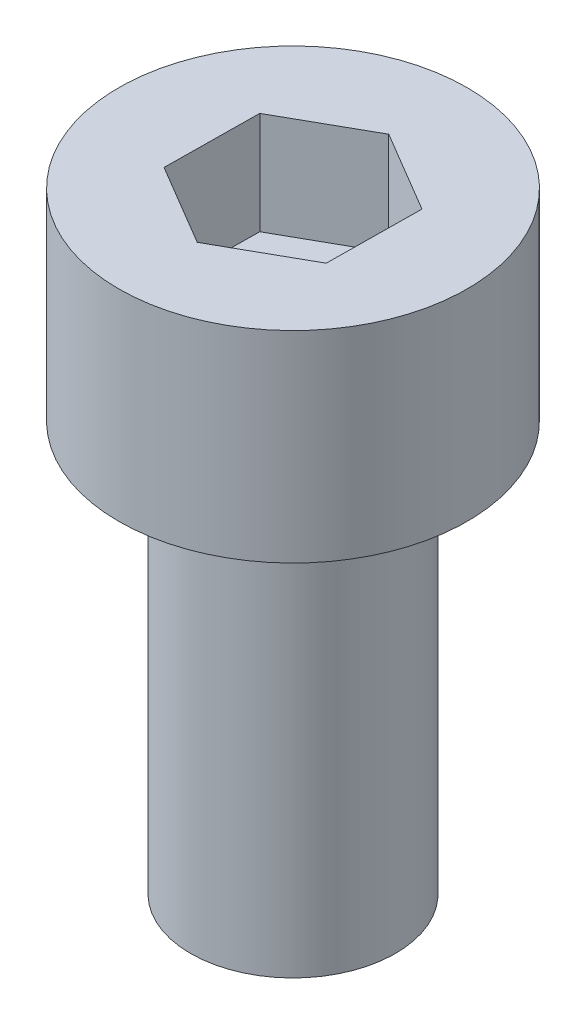
ISO-10303-21;
HEADER;
FILE_DESCRIPTION(('STEP AP214'),'2;1');
FILE_NAME('part.step','',(''),(''),'','','');
FILE_SCHEMA(('AUTOMOTIVE_DESIGN { 1 0 10303 214 1 1 1 1 }'));
ENDSEC;
DATA;
#1=APPLICATION_CONTEXT('core data for automotive mechanical design processes');
#2=APPLICATION_PROTOCOL_DEFINITION('international standard','automotive_design',2000,#1);
#3=PRODUCT_CONTEXT('',#1,'mechanical');
#4=PRODUCT('Part','Part','',(#3));
#5=PRODUCT_RELATED_PRODUCT_CATEGORY('part','',(#4));
#6=PRODUCT_DEFINITION_FORMATION('','',#4);
#7=PRODUCT_DEFINITION_CONTEXT('part definition',#1,'design');
#8=PRODUCT_DEFINITION('design','',#6,#7);
#9=PRODUCT_DEFINITION_SHAPE('','',#8);
#10=(LENGTH_UNIT() NAMED_UNIT(*) SI_UNIT(.MILLI.,.METRE.));
#11=(NAMED_UNIT(*) PLANE_ANGLE_UNIT() SI_UNIT($,.RADIAN.));
#12=(NAMED_UNIT(*) SI_UNIT($,.STERADIAN.) SOLID_ANGLE_UNIT());
#13=UNCERTAINTY_MEASURE_WITH_UNIT(LENGTH_MEASURE(1.E-05),#10,'distance_accuracy_value','');
#14=(GEOMETRIC_REPRESENTATION_CONTEXT(3) GLOBAL_UNCERTAINTY_ASSIGNED_CONTEXT((#13)) GLOBAL_UNIT_ASSIGNED_CONTEXT((#10,
#11,#12)) REPRESENTATION_CONTEXT('',''));
#15=CARTESIAN_POINT('',(0.,0.,0.));
#16=DIRECTION('',(0.,0.,1.));
#17=DIRECTION('',(1.,0.,0.));
#18=AXIS2_PLACEMENT_3D('',#15,#16,#17);
#19=CARTESIAN_POINT('',(0.,10.,0.));
#20=DIRECTION('',(0.,-1.,0.));
#21=DIRECTION('',(0.,0.,-1.));
#22=AXIS2_PLACEMENT_3D('',#19,#20,#21);
#23=CYLINDRICAL_SURFACE('',#22,2.5);
#24=CARTESIAN_POINT('',(0.,10.,0.));
#25=DIRECTION('',(0.,1.,0.));
#26=DIRECTION('',(0.,0.,1.));
#27=AXIS2_PLACEMENT_3D('',#24,#25,#26);
#28=CIRCLE('',#27,2.5);
#29=CARTESIAN_POINT('',(0.,10.,2.5));
#30=VERTEX_POINT('',#29);
#31=EDGE_CURVE('E11',#30,#30,#28,.T.);
#32=ORIENTED_EDGE('',*,*,#31,.F.);
#33=EDGE_LOOP('',(#32));
#34=FACE_BOUND('',#33,.T.);
#35=CARTESIAN_POINT('',(0.,0.,0.));
#36=DIRECTION('',(0.,1.,0.));
#37=DIRECTION('',(0.,0.,1.));
#38=AXIS2_PLACEMENT_3D('',#35,#36,#37);
#39=CIRCLE('',#38,2.5);
#40=CARTESIAN_POINT('',(0.,0.,2.5));
#41=VERTEX_POINT('',#40);
#42=EDGE_CURVE('E42',#41,#41,#39,.T.);
#43=ORIENTED_EDGE('',*,*,#42,.T.);
#44=EDGE_LOOP('',(#43));
#45=FACE_BOUND('',#44,.T.);
#46=ADVANCED_FACE('F39',(#34,#45),#23,.T.);
#47=CARTESIAN_POINT('',(0.,0.,0.));
#48=DIRECTION('',(0.,1.,0.));
#49=DIRECTION('',(0.,0.,1.));
#50=AXIS2_PLACEMENT_3D('',#47,#48,#49);
#51=PLANE('',#50);
#52=ORIENTED_EDGE('',*,*,#42,.F.);
#53=EDGE_LOOP('',(#52));
#54=FACE_BOUND('',#53,.T.);
#55=ADVANCED_FACE('F189',(#54),#51,.F.);
#56=CARTESIAN_POINT('',(0.,14.91,0.));
#57=DIRECTION('',(0.,-1.,0.));
#58=DIRECTION('',(0.,0.,-1.));
#59=AXIS2_PLACEMENT_3D('',#56,#57,#58);
#60=CYLINDRICAL_SURFACE('',#59,4.25);
#61=CARTESIAN_POINT('',(0.,14.91,0.));
#62=DIRECTION('',(0.,1.,0.));
#63=DIRECTION('',(0.,0.,1.));
#64=AXIS2_PLACEMENT_3D('',#61,#62,#63);
#65=CIRCLE('',#64,4.25);
#66=CARTESIAN_POINT('',(0.,14.91,4.25));
#67=VERTEX_POINT('',#66);
#68=EDGE_CURVE('E163',#67,#67,#65,.T.);
#69=ORIENTED_EDGE('',*,*,#68,.F.);
#70=EDGE_LOOP('',(#69));
#71=FACE_BOUND('',#70,.T.);
#72=CARTESIAN_POINT('',(0.,10.,0.));
#73=DIRECTION('',(0.,1.,0.));
#74=DIRECTION('',(0.,0.,1.));
#75=AXIS2_PLACEMENT_3D('',#72,#73,#74);
#76=CIRCLE('',#75,4.25);
#77=CARTESIAN_POINT('',(0.,10.,4.25));
#78=VERTEX_POINT('',#77);
#79=EDGE_CURVE('E153',#78,#78,#76,.T.);
#80=ORIENTED_EDGE('',*,*,#79,.T.);
#81=EDGE_LOOP('',(#80));
#82=FACE_BOUND('',#81,.T.);
#83=ADVANCED_FACE('F171',(#71,#82),#60,.T.);
#84=CARTESIAN_POINT('',(0.,14.91,0.));
#85=DIRECTION('',(0.,1.,0.));
#86=DIRECTION('',(0.,0.,1.));
#87=AXIS2_PLACEMENT_3D('',#84,#85,#86);
#88=PLANE('',#87);
#89=DIRECTION('',(0.871446941935933,0.,-0.490489783166286));
#90=VECTOR('',#89,1.);
#91=CARTESIAN_POINT('',(-0.0252806866898007,14.91,2.3092627005635));
#92=LINE('',#91,#90);
#93=CARTESIAN_POINT('',(-0.0252806866898007,14.91,2.3092627005635));
#94=VERTEX_POINT('',#93);
#95=CARTESIAN_POINT('',(1.98723981935495,14.91,1.17652506718023));
#96=VERTEX_POINT('',#95);
#97=EDGE_CURVE('E54',#94,#96,#92,.T.);
#98=ORIENTED_EDGE('',*,*,#97,.F.);
#99=DIRECTION('',(0.860500083486691,0.,0.509450298183638));
#100=VECTOR('',#99,1.);
#101=CARTESIAN_POINT('',(-2.01252050604475,14.91,1.13273763338327));
#102=LINE('',#101,#100);
#103=CARTESIAN_POINT('',(-2.01252050604475,14.91,1.13273763338327));
#104=VERTEX_POINT('',#103);
#105=EDGE_CURVE('E147',#104,#94,#102,.T.);
#106=ORIENTED_EDGE('',*,*,#105,.F.);
#107=DIRECTION('',(-0.0109468584492415,0.,0.999940081349924));
#108=VECTOR('',#107,1.);
#109=CARTESIAN_POINT('',(-1.98723981935495,14.91,-1.17652506718023));
#110=LINE('',#109,#108);
#111=CARTESIAN_POINT('',(-1.98723981935495,14.91,-1.17652506718023));
#112=VERTEX_POINT('',#111);
#113=EDGE_CURVE('E144',#112,#104,#110,.T.);
#114=ORIENTED_EDGE('',*,*,#113,.F.);
#115=DIRECTION('',(-0.871446941935933,0.,0.490489783166286));
#116=VECTOR('',#115,1.);
#117=CARTESIAN_POINT('',(0.0252806866898017,14.91,-2.3092627005635));
#118=LINE('',#117,#116);
#119=CARTESIAN_POINT('',(0.0252806866898017,14.91,-2.3092627005635));
#120=VERTEX_POINT('',#119);
#121=EDGE_CURVE('E102',#120,#112,#118,.T.);
#122=ORIENTED_EDGE('',*,*,#121,.F.);
#123=DIRECTION('',(-0.860500083486691,0.,-0.509450298183638));
#124=VECTOR('',#123,1.);
#125=CARTESIAN_POINT('',(2.01252050604475,14.91,-1.13273763338327));
#126=LINE('',#125,#124);
#127=CARTESIAN_POINT('',(2.01252050604475,14.91,-1.13273763338327));
#128=VERTEX_POINT('',#127);
#129=EDGE_CURVE('E138',#128,#120,#126,.T.);
#130=ORIENTED_EDGE('',*,*,#129,.F.);
#131=DIRECTION('',(0.0109468584492411,0.,-0.999940081349924));
#132=VECTOR('',#131,1.);
#133=CARTESIAN_POINT('',(1.98723981935495,14.91,1.17652506718023));
#134=LINE('',#133,#132);
#135=EDGE_CURVE('E134',#96,#128,#134,.T.);
#136=ORIENTED_EDGE('',*,*,#135,.F.);
#137=EDGE_LOOP('',(#98,#106,#114,#122,#130,#136));
#138=FACE_BOUND('',#137,.T.);
#139=ORIENTED_EDGE('',*,*,#68,.T.);
#140=EDGE_LOOP('',(#139));
#141=FACE_BOUND('',#140,.T.);
#142=ADVANCED_FACE('F176',(#138,#141),#88,.T.);
#143=CARTESIAN_POINT('',(0.,10.,0.));
#144=DIRECTION('',(0.,1.,0.));
#145=DIRECTION('',(0.,0.,1.));
#146=AXIS2_PLACEMENT_3D('',#143,#144,#145);
#147=PLANE('',#146);
#148=ORIENTED_EDGE('',*,*,#31,.T.);
#149=EDGE_LOOP('',(#148));
#150=FACE_BOUND('',#149,.T.);
#151=ORIENTED_EDGE('',*,*,#79,.F.);
#152=EDGE_LOOP('',(#151));
#153=FACE_BOUND('',#152,.T.);
#154=ADVANCED_FACE('F173',(#150,#153),#147,.F.);
#155=CARTESIAN_POINT('',(-0.0252806866898007,12.41,2.3092627005635));
#156=DIRECTION('',(0.490489783166286,0.,0.871446941935933));
#157=DIRECTION('',(0.871446941935933,0.,-0.490489783166286));
#158=AXIS2_PLACEMENT_3D('',#155,#156,#157);
#159=PLANE('',#158);
#160=ORIENTED_EDGE('',*,*,#97,.T.);
#161=DIRECTION('',(0.,1.,0.));
#162=VECTOR('',#161,1.);
#163=CARTESIAN_POINT('',(1.98723981935495,12.41,1.17652506718023));
#164=LINE('',#163,#162);
#165=CARTESIAN_POINT('',(1.98723981935495,12.41,1.17652506718023));
#166=VERTEX_POINT('',#165);
#167=EDGE_CURVE('E84',#166,#96,#164,.T.);
#168=ORIENTED_EDGE('',*,*,#167,.F.);
#169=DIRECTION('',(0.871446941935933,0.,-0.490489783166286));
#170=VECTOR('',#169,1.);
#171=CARTESIAN_POINT('',(-0.0252806866898007,12.41,2.3092627005635));
#172=LINE('',#171,#170);
#173=CARTESIAN_POINT('',(-0.0252806866898007,12.41,2.3092627005635));
#174=VERTEX_POINT('',#173);
#175=EDGE_CURVE('E150',#174,#166,#172,.T.);
#176=ORIENTED_EDGE('',*,*,#175,.F.);
#177=DIRECTION('',(0.,1.,0.));
#178=VECTOR('',#177,1.);
#179=CARTESIAN_POINT('',(-0.0252806866898007,12.41,2.3092627005635));
#180=LINE('',#179,#178);
#181=EDGE_CURVE('E62',#174,#94,#180,.T.);
#182=ORIENTED_EDGE('',*,*,#181,.T.);
#183=EDGE_LOOP('',(#160,#168,#176,#182));
#184=FACE_BOUND('',#183,.T.);
#185=ADVANCED_FACE('F175',(#184),#159,.F.);
#186=CARTESIAN_POINT('',(-2.01252050604475,12.41,1.13273763338327));
#187=DIRECTION('',(-0.509450298183638,0.,0.860500083486691));
#188=DIRECTION('',(0.860500083486691,0.,0.509450298183638));
#189=AXIS2_PLACEMENT_3D('',#186,#187,#188);
#190=PLANE('',#189);
#191=ORIENTED_EDGE('',*,*,#105,.T.);
#192=ORIENTED_EDGE('',*,*,#181,.F.);
#193=DIRECTION('',(0.860500083486691,0.,0.509450298183638));
#194=VECTOR('',#193,1.);
#195=CARTESIAN_POINT('',(-2.01252050604475,12.41,1.13273763338327));
#196=LINE('',#195,#194);
#197=CARTESIAN_POINT('',(-2.01252050604475,12.41,1.13273763338327));
#198=VERTEX_POINT('',#197);
#199=EDGE_CURVE('E116',#198,#174,#196,.T.);
#200=ORIENTED_EDGE('',*,*,#199,.F.);
#201=DIRECTION('',(0.,1.,0.));
#202=VECTOR('',#201,1.);
#203=CARTESIAN_POINT('',(-2.01252050604475,12.41,1.13273763338327));
#204=LINE('',#203,#202);
#205=EDGE_CURVE('E107',#198,#104,#204,.T.);
#206=ORIENTED_EDGE('',*,*,#205,.T.);
#207=EDGE_LOOP('',(#191,#192,#200,#206));
#208=FACE_BOUND('',#207,.T.);
#209=ADVANCED_FACE('F183',(#208),#190,.F.);
#210=CARTESIAN_POINT('',(-1.98723981935495,12.41,-1.17652506718023));
#211=DIRECTION('',(-0.999940081349924,0.,-0.0109468584492415));
#212=DIRECTION('',(-0.0109468584492415,0.,0.999940081349924));
#213=AXIS2_PLACEMENT_3D('',#210,#211,#212);
#214=PLANE('',#213);
#215=ORIENTED_EDGE('',*,*,#113,.T.);
#216=ORIENTED_EDGE('',*,*,#205,.F.);
#217=DIRECTION('',(-0.0109468584492415,0.,0.999940081349924));
#218=VECTOR('',#217,1.);
#219=CARTESIAN_POINT('',(-1.98723981935495,12.41,-1.17652506718023));
#220=LINE('',#219,#218);
#221=CARTESIAN_POINT('',(-1.98723981935495,12.41,-1.17652506718023));
#222=VERTEX_POINT('',#221);
#223=EDGE_CURVE('E111',#222,#198,#220,.T.);
#224=ORIENTED_EDGE('',*,*,#223,.F.);
#225=DIRECTION('',(0.,1.,0.));
#226=VECTOR('',#225,1.);
#227=CARTESIAN_POINT('',(-1.98723981935495,12.41,-1.17652506718023));
#228=LINE('',#227,#226);
#229=EDGE_CURVE('E95',#222,#112,#228,.T.);
#230=ORIENTED_EDGE('',*,*,#229,.T.);
#231=EDGE_LOOP('',(#215,#216,#224,#230));
#232=FACE_BOUND('',#231,.T.);
#233=ADVANCED_FACE('F112',(#232),#214,.F.);
#234=CARTESIAN_POINT('',(0.0252806866898017,12.41,-2.3092627005635));
#235=DIRECTION('',(-0.490489783166286,0.,-0.871446941935933));
#236=DIRECTION('',(-0.871446941935933,0.,0.490489783166286));
#237=AXIS2_PLACEMENT_3D('',#234,#235,#236);
#238=PLANE('',#237);
#239=ORIENTED_EDGE('',*,*,#121,.T.);
#240=ORIENTED_EDGE('',*,*,#229,.F.);
#241=DIRECTION('',(-0.871446941935933,0.,0.490489783166286));
#242=VECTOR('',#241,1.);
#243=CARTESIAN_POINT('',(0.0252806866898017,12.41,-2.3092627005635));
#244=LINE('',#243,#242);
#245=CARTESIAN_POINT('',(0.0252806866898017,12.41,-2.3092627005635));
#246=VERTEX_POINT('',#245);
#247=EDGE_CURVE('E99',#246,#222,#244,.T.);
#248=ORIENTED_EDGE('',*,*,#247,.F.);
#249=DIRECTION('',(0.,1.,0.));
#250=VECTOR('',#249,1.);
#251=CARTESIAN_POINT('',(0.0252806866898017,12.41,-2.3092627005635));
#252=LINE('',#251,#250);
#253=EDGE_CURVE('E108',#246,#120,#252,.T.);
#254=ORIENTED_EDGE('',*,*,#253,.T.);
#255=EDGE_LOOP('',(#239,#240,#248,#254));
#256=FACE_BOUND('',#255,.T.);
#257=ADVANCED_FACE('F97',(#256),#238,.F.);
#258=CARTESIAN_POINT('',(2.01252050604475,12.41,-1.13273763338327));
#259=DIRECTION('',(0.509450298183638,0.,-0.860500083486691));
#260=DIRECTION('',(-0.860500083486691,0.,-0.509450298183638));
#261=AXIS2_PLACEMENT_3D('',#258,#259,#260);
#262=PLANE('',#261);
#263=ORIENTED_EDGE('',*,*,#129,.T.);
#264=ORIENTED_EDGE('',*,*,#253,.F.);
#265=DIRECTION('',(-0.860500083486691,0.,-0.509450298183638));
#266=VECTOR('',#265,1.);
#267=CARTESIAN_POINT('',(2.01252050604475,12.41,-1.13273763338327));
#268=LINE('',#267,#266);
#269=CARTESIAN_POINT('',(2.01252050604475,12.41,-1.13273763338327));
#270=VERTEX_POINT('',#269);
#271=EDGE_CURVE('E122',#270,#246,#268,.T.);
#272=ORIENTED_EDGE('',*,*,#271,.F.);
#273=DIRECTION('',(0.,1.,0.));
#274=VECTOR('',#273,1.);
#275=CARTESIAN_POINT('',(2.01252050604475,12.41,-1.13273763338327));
#276=LINE('',#275,#274);
#277=EDGE_CURVE('E158',#270,#128,#276,.T.);
#278=ORIENTED_EDGE('',*,*,#277,.T.);
#279=EDGE_LOOP('',(#263,#264,#272,#278));
#280=FACE_BOUND('',#279,.T.);
#281=ADVANCED_FACE('F245',(#280),#262,.F.);
#282=CARTESIAN_POINT('',(1.98723981935495,12.41,1.17652506718023));
#283=DIRECTION('',(0.999940081349924,0.,0.0109468584492411));
#284=DIRECTION('',(0.0109468584492411,0.,-0.999940081349924));
#285=AXIS2_PLACEMENT_3D('',#282,#283,#284);
#286=PLANE('',#285);
#287=ORIENTED_EDGE('',*,*,#135,.T.);
#288=ORIENTED_EDGE('',*,*,#277,.F.);
#289=DIRECTION('',(0.0109468584492411,0.,-0.999940081349924));
#290=VECTOR('',#289,1.);
#291=CARTESIAN_POINT('',(1.98723981935495,12.41,1.17652506718023));
#292=LINE('',#291,#290);
#293=EDGE_CURVE('E126',#166,#270,#292,.T.);
#294=ORIENTED_EDGE('',*,*,#293,.F.);
#295=ORIENTED_EDGE('',*,*,#167,.T.);
#296=EDGE_LOOP('',(#287,#288,#294,#295));
#297=FACE_BOUND('',#296,.T.);
#298=ADVANCED_FACE('F254',(#297),#286,.F.);
#299=CARTESIAN_POINT('',(0.,12.41,0.));
#300=DIRECTION('',(0.,1.,0.));
#301=DIRECTION('',(0.,0.,1.));
#302=AXIS2_PLACEMENT_3D('',#299,#300,#301);
#303=PLANE('',#302);
#304=ORIENTED_EDGE('',*,*,#175,.T.);
#305=ORIENTED_EDGE('',*,*,#293,.T.);
#306=ORIENTED_EDGE('',*,*,#271,.T.);
#307=ORIENTED_EDGE('',*,*,#247,.T.);
#308=ORIENTED_EDGE('',*,*,#223,.T.);
#309=ORIENTED_EDGE('',*,*,#199,.T.);
#310=EDGE_LOOP('',(#304,#305,#306,#307,#308,#309));
#311=FACE_BOUND('',#310,.T.);
#312=ADVANCED_FACE('F119',(#311),#303,.T.);
#313=CLOSED_SHELL('',(#46,#55,#83,#142,#154,#185,#209,#233,#257,#281,#298,#312));
#314=MANIFOLD_SOLID_BREP('B2',#313);
#315=ADVANCED_BREP_SHAPE_REPRESENTATION('',(#18,#314),#14);
#316=SHAPE_DEFINITION_REPRESENTATION(#9,#315);
ENDSEC;
END-ISO-10303-21;
